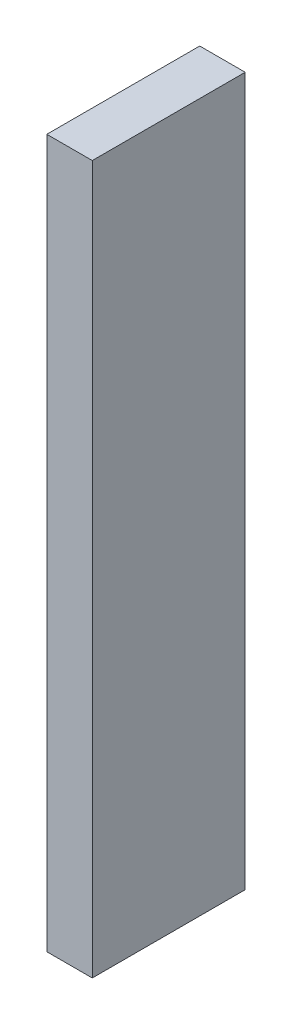
ISO-10303-21;
HEADER;
FILE_DESCRIPTION(('STEP AP214'),'2;1');
FILE_NAME('part.step','',(''),(''),'','','');
FILE_SCHEMA(('AUTOMOTIVE_DESIGN { 1 0 10303 214 1 1 1 1 }'));
ENDSEC;
DATA;
#1=APPLICATION_CONTEXT('core data for automotive mechanical design processes');
#2=APPLICATION_PROTOCOL_DEFINITION('international standard','automotive_design',2000,#1);
#3=PRODUCT_CONTEXT('',#1,'mechanical');
#4=PRODUCT('Part','Part','',(#3));
#5=PRODUCT_RELATED_PRODUCT_CATEGORY('part','',(#4));
#6=PRODUCT_DEFINITION_FORMATION('','',#4);
#7=PRODUCT_DEFINITION_CONTEXT('part definition',#1,'design');
#8=PRODUCT_DEFINITION('design','',#6,#7);
#9=PRODUCT_DEFINITION_SHAPE('','',#8);
#10=(LENGTH_UNIT() NAMED_UNIT(*) SI_UNIT(.MILLI.,.METRE.));
#11=(NAMED_UNIT(*) PLANE_ANGLE_UNIT() SI_UNIT($,.RADIAN.));
#12=(NAMED_UNIT(*) SI_UNIT($,.STERADIAN.) SOLID_ANGLE_UNIT());
#13=UNCERTAINTY_MEASURE_WITH_UNIT(LENGTH_MEASURE(1.E-05),#10,'distance_accuracy_value','');
#14=(GEOMETRIC_REPRESENTATION_CONTEXT(3) GLOBAL_UNCERTAINTY_ASSIGNED_CONTEXT((#13)) GLOBAL_UNIT_ASSIGNED_CONTEXT((#10,
#11,#12)) REPRESENTATION_CONTEXT('',''));
#15=CARTESIAN_POINT('',(0.,0.,0.));
#16=DIRECTION('',(0.,0.,1.));
#17=DIRECTION('',(1.,0.,0.));
#18=AXIS2_PLACEMENT_3D('',#15,#16,#17);
#19=CARTESIAN_POINT('',(130.275545136319,22.4180708263693,131.072024477607));
#20=DIRECTION('',(-1.69244514382854E-09,0.,1.));
#21=DIRECTION('',(1.,0.,1.69244514382854E-09));
#22=AXIS2_PLACEMENT_3D('',#19,#20,#21);
#23=PLANE('',#22);
#24=DIRECTION('',(0.,-1.,0.));
#25=VECTOR('',#24,1.);
#26=CARTESIAN_POINT('',(131.258630233332,22.4180708263693,131.07202447927));
#27=LINE('',#26,#25);
#28=CARTESIAN_POINT('',(131.258630233332,22.4180708263693,131.07202447927));
#29=VERTEX_POINT('',#28);
#30=CARTESIAN_POINT('',(131.258630233332,7.11212965552235,131.07202447927));
#31=VERTEX_POINT('',#30);
#32=EDGE_CURVE('E79',#29,#31,#27,.T.);
#33=ORIENTED_EDGE('',*,*,#32,.F.);
#34=DIRECTION('',(1.,0.,1.69244514382854E-09));
#35=VECTOR('',#34,1.);
#36=CARTESIAN_POINT('',(130.275545136319,22.4180708263693,131.072024477607));
#37=LINE('',#36,#35);
#38=CARTESIAN_POINT('',(130.275545136319,22.4180708263693,131.072024477607));
#39=VERTEX_POINT('',#38);
#40=EDGE_CURVE('E32',#39,#29,#37,.T.);
#41=ORIENTED_EDGE('',*,*,#40,.F.);
#42=DIRECTION('',(0.,-1.,0.));
#43=VECTOR('',#42,1.);
#44=CARTESIAN_POINT('',(130.275545136319,22.4180708263693,131.072024477607));
#45=LINE('',#44,#43);
#46=CARTESIAN_POINT('',(130.275545136319,7.11212965552235,131.072024477607));
#47=VERTEX_POINT('',#46);
#48=EDGE_CURVE('E71',#39,#47,#45,.T.);
#49=ORIENTED_EDGE('',*,*,#48,.T.);
#50=DIRECTION('',(1.,0.,1.69244514382854E-09));
#51=VECTOR('',#50,1.);
#52=CARTESIAN_POINT('',(130.275545136319,7.11212965552235,131.072024477607));
#53=LINE('',#52,#51);
#54=EDGE_CURVE('E10',#47,#31,#53,.T.);
#55=ORIENTED_EDGE('',*,*,#54,.T.);
#56=EDGE_LOOP('',(#33,#41,#49,#55));
#57=FACE_BOUND('',#56,.T.);
#58=ADVANCED_FACE('F16',(#57),#23,.T.);
#59=CARTESIAN_POINT('',(130.275545136319,7.11212965552235,131.072024477607));
#60=DIRECTION('',(0.,-1.,0.));
#61=DIRECTION('',(0.,0.,-1.));
#62=AXIS2_PLACEMENT_3D('',#59,#60,#61);
#63=PLANE('',#62);
#64=DIRECTION('',(1.69244514382854E-09,0.,-1.));
#65=VECTOR('',#64,1.);
#66=CARTESIAN_POINT('',(131.258630233332,7.11212965552235,131.07202447927));
#67=LINE('',#66,#65);
#68=CARTESIAN_POINT('',(131.258630238927,7.11212965552235,127.766083308422));
#69=VERTEX_POINT('',#68);
#70=EDGE_CURVE('E82',#31,#69,#67,.T.);
#71=ORIENTED_EDGE('',*,*,#70,.F.);
#72=ORIENTED_EDGE('',*,*,#54,.F.);
#73=DIRECTION('',(1.69244514382854E-09,0.,-1.));
#74=VECTOR('',#73,1.);
#75=CARTESIAN_POINT('',(130.275545136319,7.11212965552235,131.072024477607));
#76=LINE('',#75,#74);
#77=CARTESIAN_POINT('',(130.275545141914,7.11212965552235,127.766083306758));
#78=VERTEX_POINT('',#77);
#79=EDGE_CURVE('E67',#47,#78,#76,.T.);
#80=ORIENTED_EDGE('',*,*,#79,.T.);
#81=DIRECTION('',(1.,0.,1.69244514382854E-09));
#82=VECTOR('',#81,1.);
#83=CARTESIAN_POINT('',(130.275545141914,7.11212965552235,127.766083306758));
#84=LINE('',#83,#82);
#85=EDGE_CURVE('E24',#78,#69,#84,.T.);
#86=ORIENTED_EDGE('',*,*,#85,.T.);
#87=EDGE_LOOP('',(#71,#72,#80,#86));
#88=FACE_BOUND('',#87,.T.);
#89=ADVANCED_FACE('F68',(#88),#63,.T.);
#90=CARTESIAN_POINT('',(130.275545141914,7.11212965552235,127.766083306758));
#91=DIRECTION('',(1.69244514382854E-09,0.,-1.));
#92=DIRECTION('',(-1.,0.,-1.69244514382854E-09));
#93=AXIS2_PLACEMENT_3D('',#90,#91,#92);
#94=PLANE('',#93);
#95=DIRECTION('',(0.,1.,0.));
#96=VECTOR('',#95,1.);
#97=CARTESIAN_POINT('',(131.258630238927,7.11212965552235,127.766083308422));
#98=LINE('',#97,#96);
#99=CARTESIAN_POINT('',(131.258630238927,22.418070826371,127.766083299961));
#100=VERTEX_POINT('',#99);
#101=EDGE_CURVE('E65',#69,#100,#98,.T.);
#102=ORIENTED_EDGE('',*,*,#101,.F.);
#103=ORIENTED_EDGE('',*,*,#85,.F.);
#104=DIRECTION('',(0.,1.,0.));
#105=VECTOR('',#104,1.);
#106=CARTESIAN_POINT('',(130.275545141914,7.11212965552235,127.766083306758));
#107=LINE('',#106,#105);
#108=CARTESIAN_POINT('',(130.275545141914,22.418070826371,127.766083298297));
#109=VERTEX_POINT('',#108);
#110=EDGE_CURVE('E62',#78,#109,#107,.T.);
#111=ORIENTED_EDGE('',*,*,#110,.T.);
#112=DIRECTION('',(1.,0.,1.69244514382854E-09));
#113=VECTOR('',#112,1.);
#114=CARTESIAN_POINT('',(130.275545141914,22.418070826371,127.766083298297));
#115=LINE('',#114,#113);
#116=EDGE_CURVE('E48',#109,#100,#115,.T.);
#117=ORIENTED_EDGE('',*,*,#116,.T.);
#118=EDGE_LOOP('',(#102,#103,#111,#117));
#119=FACE_BOUND('',#118,.T.);
#120=ADVANCED_FACE('F60',(#119),#94,.T.);
#121=CARTESIAN_POINT('',(130.275545141914,22.418070826371,127.766083298297));
#122=DIRECTION('',(0.,1.,0.));
#123=DIRECTION('',(-1.,0.,0.));
#124=AXIS2_PLACEMENT_3D('',#121,#122,#123);
#125=PLANE('',#124);
#126=DIRECTION('',(-1.69244514382854E-09,0.,1.));
#127=VECTOR('',#126,1.);
#128=CARTESIAN_POINT('',(131.258630238927,22.418070826371,127.766083299961));
#129=LINE('',#128,#127);
#130=EDGE_CURVE('E85',#100,#29,#129,.T.);
#131=ORIENTED_EDGE('',*,*,#130,.F.);
#132=ORIENTED_EDGE('',*,*,#116,.F.);
#133=DIRECTION('',(-1.69244514382854E-09,0.,1.));
#134=VECTOR('',#133,1.);
#135=CARTESIAN_POINT('',(130.275545141914,22.418070826371,127.766083298297));
#136=LINE('',#135,#134);
#137=EDGE_CURVE('E74',#109,#39,#136,.T.);
#138=ORIENTED_EDGE('',*,*,#137,.T.);
#139=ORIENTED_EDGE('',*,*,#40,.T.);
#140=EDGE_LOOP('',(#131,#132,#138,#139));
#141=FACE_BOUND('',#140,.T.);
#142=ADVANCED_FACE('F96',(#141),#125,.T.);
#143=CARTESIAN_POINT('',(130.275545201028,17.2651002409467,92.8378607087388));
#144=DIRECTION('',(1.,0.,1.69244514382854E-09));
#145=DIRECTION('',(0.,1.,0.));
#146=AXIS2_PLACEMENT_3D('',#143,#144,#145);
#147=PLANE('',#146);
#148=ORIENTED_EDGE('',*,*,#48,.F.);
#149=ORIENTED_EDGE('',*,*,#137,.F.);
#150=ORIENTED_EDGE('',*,*,#110,.F.);
#151=ORIENTED_EDGE('',*,*,#79,.F.);
#152=EDGE_LOOP('',(#148,#149,#150,#151));
#153=FACE_BOUND('',#152,.T.);
#154=ADVANCED_FACE('F73',(#153),#147,.F.);
#155=CARTESIAN_POINT('',(131.258630298041,17.2651002409467,92.8378607104026));
#156=DIRECTION('',(1.,0.,1.69244514382854E-09));
#157=DIRECTION('',(0.,1.,0.));
#158=AXIS2_PLACEMENT_3D('',#155,#156,#157);
#159=PLANE('',#158);
#160=ORIENTED_EDGE('',*,*,#32,.T.);
#161=ORIENTED_EDGE('',*,*,#70,.T.);
#162=ORIENTED_EDGE('',*,*,#101,.T.);
#163=ORIENTED_EDGE('',*,*,#130,.T.);
#164=EDGE_LOOP('',(#160,#161,#162,#163));
#165=FACE_BOUND('',#164,.T.);
#166=ADVANCED_FACE('F89',(#165),#159,.T.);
#167=CLOSED_SHELL('',(#58,#89,#120,#142,#154,#166));
#168=MANIFOLD_SOLID_BREP('B1',#167);
#169=ADVANCED_BREP_SHAPE_REPRESENTATION('',(#18,#168),#14);
#170=SHAPE_DEFINITION_REPRESENTATION(#9,#169);
ENDSEC;
END-ISO-10303-21;
